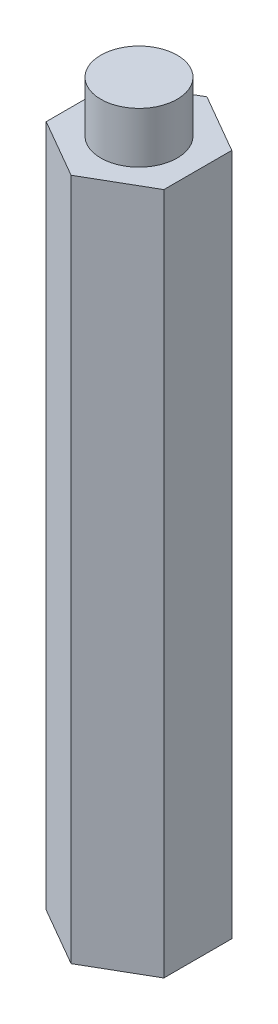
ISO-10303-21;
HEADER;
FILE_DESCRIPTION(('STEP AP214'),'2;1');
FILE_NAME('part.step','',(''),(''),'','','');
FILE_SCHEMA(('AUTOMOTIVE_DESIGN { 1 0 10303 214 1 1 1 1 }'));
ENDSEC;
DATA;
#1=APPLICATION_CONTEXT('core data for automotive mechanical design processes');
#2=APPLICATION_PROTOCOL_DEFINITION('international standard','automotive_design',2000,#1);
#3=PRODUCT_CONTEXT('',#1,'mechanical');
#4=PRODUCT('Part','Part','',(#3));
#5=PRODUCT_RELATED_PRODUCT_CATEGORY('part','',(#4));
#6=PRODUCT_DEFINITION_FORMATION('','',#4);
#7=PRODUCT_DEFINITION_CONTEXT('part definition',#1,'design');
#8=PRODUCT_DEFINITION('design','',#6,#7);
#9=PRODUCT_DEFINITION_SHAPE('','',#8);
#10=(LENGTH_UNIT() NAMED_UNIT(*) SI_UNIT(.MILLI.,.METRE.));
#11=(NAMED_UNIT(*) PLANE_ANGLE_UNIT() SI_UNIT($,.RADIAN.));
#12=(NAMED_UNIT(*) SI_UNIT($,.STERADIAN.) SOLID_ANGLE_UNIT());
#13=UNCERTAINTY_MEASURE_WITH_UNIT(LENGTH_MEASURE(1.E-05),#10,'distance_accuracy_value','');
#14=(GEOMETRIC_REPRESENTATION_CONTEXT(3) GLOBAL_UNCERTAINTY_ASSIGNED_CONTEXT((#13)) GLOBAL_UNIT_ASSIGNED_CONTEXT((#10,
#11,#12)) REPRESENTATION_CONTEXT('',''));
#15=CARTESIAN_POINT('',(0.,0.,0.));
#16=DIRECTION('',(0.,0.,1.));
#17=DIRECTION('',(1.,0.,0.));
#18=AXIS2_PLACEMENT_3D('',#15,#16,#17);
#19=CARTESIAN_POINT('',(-3.46410161513776,40.21,2.));
#20=DIRECTION('',(0.5,0.,-0.866025403784439));
#21=DIRECTION('',(-0.866025403784439,0.,-0.5));
#22=AXIS2_PLACEMENT_3D('',#19,#20,#21);
#23=PLANE('',#22);
#24=DIRECTION('',(0.866025403784439,0.,0.5));
#25=VECTOR('',#24,1.);
#26=CARTESIAN_POINT('',(-3.46410161513776,0.,2.));
#27=LINE('',#26,#25);
#28=CARTESIAN_POINT('',(-3.46410161513776,0.,2.));
#29=VERTEX_POINT('',#28);
#30=CARTESIAN_POINT('',(0.,0.,4.));
#31=VERTEX_POINT('',#30);
#32=EDGE_CURVE('E129',#29,#31,#27,.T.);
#33=ORIENTED_EDGE('',*,*,#32,.T.);
#34=DIRECTION('',(0.,-1.,0.));
#35=VECTOR('',#34,1.);
#36=CARTESIAN_POINT('',(0.,40.21,4.));
#37=LINE('',#36,#35);
#38=CARTESIAN_POINT('',(0.,40.21,4.));
#39=VERTEX_POINT('',#38);
#40=EDGE_CURVE('E48',#39,#31,#37,.T.);
#41=ORIENTED_EDGE('',*,*,#40,.F.);
#42=DIRECTION('',(0.866025403784439,0.,0.5));
#43=VECTOR('',#42,1.);
#44=CARTESIAN_POINT('',(-3.46410161513776,40.21,2.));
#45=LINE('',#44,#43);
#46=CARTESIAN_POINT('',(-3.46410161513776,40.21,2.));
#47=VERTEX_POINT('',#46);
#48=EDGE_CURVE('E146',#47,#39,#45,.T.);
#49=ORIENTED_EDGE('',*,*,#48,.F.);
#50=DIRECTION('',(0.,-1.,0.));
#51=VECTOR('',#50,1.);
#52=CARTESIAN_POINT('',(-3.46410161513776,40.21,2.));
#53=LINE('',#52,#51);
#54=EDGE_CURVE('E125',#47,#29,#53,.T.);
#55=ORIENTED_EDGE('',*,*,#54,.T.);
#56=EDGE_LOOP('',(#33,#41,#49,#55));
#57=FACE_BOUND('',#56,.T.);
#58=ADVANCED_FACE('F39',(#57),#23,.F.);
#59=CARTESIAN_POINT('',(0.,40.21,4.));
#60=DIRECTION('',(-0.5,0.,-0.866025403784439));
#61=DIRECTION('',(-0.866025403784439,0.,0.5));
#62=AXIS2_PLACEMENT_3D('',#59,#60,#61);
#63=PLANE('',#62);
#64=DIRECTION('',(0.866025403784439,0.,-0.5));
#65=VECTOR('',#64,1.);
#66=CARTESIAN_POINT('',(0.,0.,4.));
#67=LINE('',#66,#65);
#68=CARTESIAN_POINT('',(3.46410161513775,0.,2.));
#69=VERTEX_POINT('',#68);
#70=EDGE_CURVE('E133',#31,#69,#67,.T.);
#71=ORIENTED_EDGE('',*,*,#70,.T.);
#72=DIRECTION('',(0.,-1.,0.));
#73=VECTOR('',#72,1.);
#74=CARTESIAN_POINT('',(3.46410161513775,40.21,2.));
#75=LINE('',#74,#73);
#76=CARTESIAN_POINT('',(3.46410161513775,40.21,2.));
#77=VERTEX_POINT('',#76);
#78=EDGE_CURVE('E153',#77,#69,#75,.T.);
#79=ORIENTED_EDGE('',*,*,#78,.F.);
#80=DIRECTION('',(0.866025403784439,0.,-0.5));
#81=VECTOR('',#80,1.);
#82=CARTESIAN_POINT('',(0.,40.21,4.));
#83=LINE('',#82,#81);
#84=EDGE_CURVE('E94',#39,#77,#83,.T.);
#85=ORIENTED_EDGE('',*,*,#84,.F.);
#86=ORIENTED_EDGE('',*,*,#40,.T.);
#87=EDGE_LOOP('',(#71,#79,#85,#86));
#88=FACE_BOUND('',#87,.T.);
#89=ADVANCED_FACE('F158',(#88),#63,.F.);
#90=CARTESIAN_POINT('',(3.46410161513775,40.21,2.));
#91=DIRECTION('',(-1.,0.,0.));
#92=DIRECTION('',(0.,0.,1.));
#93=AXIS2_PLACEMENT_3D('',#90,#91,#92);
#94=PLANE('',#93);
#95=DIRECTION('',(0.,0.,-1.));
#96=VECTOR('',#95,1.);
#97=CARTESIAN_POINT('',(3.46410161513775,0.,2.));
#98=LINE('',#97,#96);
#99=CARTESIAN_POINT('',(3.46410161513775,0.,-2.));
#100=VERTEX_POINT('',#99);
#101=EDGE_CURVE('E137',#69,#100,#98,.T.);
#102=ORIENTED_EDGE('',*,*,#101,.T.);
#103=DIRECTION('',(0.,-1.,0.));
#104=VECTOR('',#103,1.);
#105=CARTESIAN_POINT('',(3.46410161513775,40.21,-2.));
#106=LINE('',#105,#104);
#107=CARTESIAN_POINT('',(3.46410161513775,40.21,-2.));
#108=VERTEX_POINT('',#107);
#109=EDGE_CURVE('E118',#108,#100,#106,.T.);
#110=ORIENTED_EDGE('',*,*,#109,.F.);
#111=DIRECTION('',(0.,0.,-1.));
#112=VECTOR('',#111,1.);
#113=CARTESIAN_POINT('',(3.46410161513775,40.21,2.));
#114=LINE('',#113,#112);
#115=EDGE_CURVE('E107',#77,#108,#114,.T.);
#116=ORIENTED_EDGE('',*,*,#115,.F.);
#117=ORIENTED_EDGE('',*,*,#78,.T.);
#118=EDGE_LOOP('',(#102,#110,#116,#117));
#119=FACE_BOUND('',#118,.T.);
#120=ADVANCED_FACE('F166',(#119),#94,.F.);
#121=CARTESIAN_POINT('',(3.46410161513775,40.21,-2.));
#122=DIRECTION('',(-0.5,0.,0.866025403784439));
#123=DIRECTION('',(0.866025403784439,0.,0.5));
#124=AXIS2_PLACEMENT_3D('',#121,#122,#123);
#125=PLANE('',#124);
#126=DIRECTION('',(-0.866025403784439,0.,-0.5));
#127=VECTOR('',#126,1.);
#128=CARTESIAN_POINT('',(3.46410161513775,0.,-2.));
#129=LINE('',#128,#127);
#130=CARTESIAN_POINT('',(0.,0.,-4.));
#131=VERTEX_POINT('',#130);
#132=EDGE_CURVE('E116',#100,#131,#129,.T.);
#133=ORIENTED_EDGE('',*,*,#132,.T.);
#134=DIRECTION('',(0.,-1.,0.));
#135=VECTOR('',#134,1.);
#136=CARTESIAN_POINT('',(0.,40.21,-4.));
#137=LINE('',#136,#135);
#138=CARTESIAN_POINT('',(0.,40.21,-4.));
#139=VERTEX_POINT('',#138);
#140=EDGE_CURVE('E113',#139,#131,#137,.T.);
#141=ORIENTED_EDGE('',*,*,#140,.F.);
#142=DIRECTION('',(-0.866025403784439,0.,-0.5));
#143=VECTOR('',#142,1.);
#144=CARTESIAN_POINT('',(3.46410161513775,40.21,-2.));
#145=LINE('',#144,#143);
#146=EDGE_CURVE('E101',#108,#139,#145,.T.);
#147=ORIENTED_EDGE('',*,*,#146,.F.);
#148=ORIENTED_EDGE('',*,*,#109,.T.);
#149=EDGE_LOOP('',(#133,#141,#147,#148));
#150=FACE_BOUND('',#149,.T.);
#151=ADVANCED_FACE('F114',(#150),#125,.F.);
#152=CARTESIAN_POINT('',(0.,40.21,-4.));
#153=DIRECTION('',(0.5,0.,0.866025403784439));
#154=DIRECTION('',(0.866025403784439,0.,-0.5));
#155=AXIS2_PLACEMENT_3D('',#152,#153,#154);
#156=PLANE('',#155);
#157=DIRECTION('',(-0.866025403784439,0.,0.5));
#158=VECTOR('',#157,1.);
#159=CARTESIAN_POINT('',(0.,0.,-4.));
#160=LINE('',#159,#158);
#161=CARTESIAN_POINT('',(-3.46410161513776,0.,-2.));
#162=VERTEX_POINT('',#161);
#163=EDGE_CURVE('E79',#131,#162,#160,.T.);
#164=ORIENTED_EDGE('',*,*,#163,.T.);
#165=DIRECTION('',(0.,-1.,0.));
#166=VECTOR('',#165,1.);
#167=CARTESIAN_POINT('',(-3.46410161513776,40.21,-2.));
#168=LINE('',#167,#166);
#169=CARTESIAN_POINT('',(-3.46410161513776,40.21,-2.));
#170=VERTEX_POINT('',#169);
#171=EDGE_CURVE('E119',#170,#162,#168,.T.);
#172=ORIENTED_EDGE('',*,*,#171,.F.);
#173=DIRECTION('',(-0.866025403784439,0.,0.5));
#174=VECTOR('',#173,1.);
#175=CARTESIAN_POINT('',(0.,40.21,-4.));
#176=LINE('',#175,#174);
#177=EDGE_CURVE('E105',#139,#170,#176,.T.);
#178=ORIENTED_EDGE('',*,*,#177,.F.);
#179=ORIENTED_EDGE('',*,*,#140,.T.);
#180=EDGE_LOOP('',(#164,#172,#178,#179));
#181=FACE_BOUND('',#180,.T.);
#182=ADVANCED_FACE('F121',(#181),#156,.F.);
#183=CARTESIAN_POINT('',(-3.46410161513776,40.21,-2.));
#184=DIRECTION('',(1.,0.,0.));
#185=DIRECTION('',(0.,0.,-1.));
#186=AXIS2_PLACEMENT_3D('',#183,#184,#185);
#187=PLANE('',#186);
#188=DIRECTION('',(0.,0.,1.));
#189=VECTOR('',#188,1.);
#190=CARTESIAN_POINT('',(-3.46410161513776,0.,-2.));
#191=LINE('',#190,#189);
#192=EDGE_CURVE('E85',#162,#29,#191,.T.);
#193=ORIENTED_EDGE('',*,*,#192,.T.);
#194=ORIENTED_EDGE('',*,*,#54,.F.);
#195=DIRECTION('',(0.,0.,1.));
#196=VECTOR('',#195,1.);
#197=CARTESIAN_POINT('',(-3.46410161513776,40.21,-2.));
#198=LINE('',#197,#196);
#199=EDGE_CURVE('E56',#170,#47,#198,.T.);
#200=ORIENTED_EDGE('',*,*,#199,.F.);
#201=ORIENTED_EDGE('',*,*,#171,.T.);
#202=EDGE_LOOP('',(#193,#194,#200,#201));
#203=FACE_BOUND('',#202,.T.);
#204=ADVANCED_FACE('F203',(#203),#187,.F.);
#205=CARTESIAN_POINT('',(0.,40.21,0.));
#206=DIRECTION('',(0.,1.,0.));
#207=DIRECTION('',(0.,0.,1.));
#208=AXIS2_PLACEMENT_3D('',#205,#206,#207);
#209=PLANE('',#208);
#210=CARTESIAN_POINT('',(0.,40.21,0.));
#211=DIRECTION('',(0.,1.,0.));
#212=DIRECTION('',(0.,0.,1.));
#213=AXIS2_PLACEMENT_3D('',#210,#211,#212);
#214=CIRCLE('',#213,2.25);
#215=CARTESIAN_POINT('',(0.,40.21,2.25));
#216=VERTEX_POINT('',#215);
#217=EDGE_CURVE('E11',#216,#216,#214,.T.);
#218=ORIENTED_EDGE('',*,*,#217,.F.);
#219=EDGE_LOOP('',(#218));
#220=FACE_BOUND('',#219,.T.);
#221=ORIENTED_EDGE('',*,*,#48,.T.);
#222=ORIENTED_EDGE('',*,*,#84,.T.);
#223=ORIENTED_EDGE('',*,*,#115,.T.);
#224=ORIENTED_EDGE('',*,*,#146,.T.);
#225=ORIENTED_EDGE('',*,*,#177,.T.);
#226=ORIENTED_EDGE('',*,*,#199,.T.);
#227=EDGE_LOOP('',(#221,#222,#223,#224,#225,#226));
#228=FACE_BOUND('',#227,.T.);
#229=ADVANCED_FACE('F103',(#220,#228),#209,.T.);
#230=CARTESIAN_POINT('',(0.,0.,0.));
#231=DIRECTION('',(0.,1.,0.));
#232=DIRECTION('',(0.,0.,1.));
#233=AXIS2_PLACEMENT_3D('',#230,#231,#232);
#234=PLANE('',#233);
#235=ORIENTED_EDGE('',*,*,#32,.F.);
#236=ORIENTED_EDGE('',*,*,#192,.F.);
#237=ORIENTED_EDGE('',*,*,#163,.F.);
#238=ORIENTED_EDGE('',*,*,#132,.F.);
#239=ORIENTED_EDGE('',*,*,#101,.F.);
#240=ORIENTED_EDGE('',*,*,#70,.F.);
#241=EDGE_LOOP('',(#235,#236,#237,#238,#239,#240));
#242=FACE_BOUND('',#241,.T.);
#243=ADVANCED_FACE('F163',(#242),#234,.F.);
#244=CARTESIAN_POINT('',(0.,10.21,0.));
#245=DIRECTION('',(0.,1.,0.));
#246=DIRECTION('',(0.,0.,1.));
#247=AXIS2_PLACEMENT_3D('',#244,#245,#246);
#248=CYLINDRICAL_SURFACE('',#247,2.25);
#249=ORIENTED_EDGE('',*,*,#217,.T.);
#250=EDGE_LOOP('',(#249));
#251=FACE_BOUND('',#250,.T.);
#252=CARTESIAN_POINT('',(0.,43.21,0.));
#253=DIRECTION('',(0.,1.,0.));
#254=DIRECTION('',(0.,0.,1.));
#255=AXIS2_PLACEMENT_3D('',#252,#253,#254);
#256=CIRCLE('',#255,2.25);
#257=CARTESIAN_POINT('',(0.,43.21,2.25));
#258=VERTEX_POINT('',#257);
#259=EDGE_CURVE('E134',#258,#258,#256,.T.);
#260=ORIENTED_EDGE('',*,*,#259,.F.);
#261=EDGE_LOOP('',(#260));
#262=FACE_BOUND('',#261,.T.);
#263=ADVANCED_FACE('F179',(#251,#262),#248,.T.);
#264=CARTESIAN_POINT('',(0.,43.21,0.));
#265=DIRECTION('',(0.,1.,0.));
#266=DIRECTION('',(0.,0.,1.));
#267=AXIS2_PLACEMENT_3D('',#264,#265,#266);
#268=PLANE('',#267);
#269=ORIENTED_EDGE('',*,*,#259,.T.);
#270=EDGE_LOOP('',(#269));
#271=FACE_BOUND('',#270,.T.);
#272=ADVANCED_FACE('F177',(#271),#268,.T.);
#273=CLOSED_SHELL('',(#58,#89,#120,#151,#182,#204,#229,#243,#263,#272));
#274=MANIFOLD_SOLID_BREP('B2',#273);
#275=ADVANCED_BREP_SHAPE_REPRESENTATION('',(#18,#274),#14);
#276=SHAPE_DEFINITION_REPRESENTATION(#9,#275);
ENDSEC;
END-ISO-10303-21;
